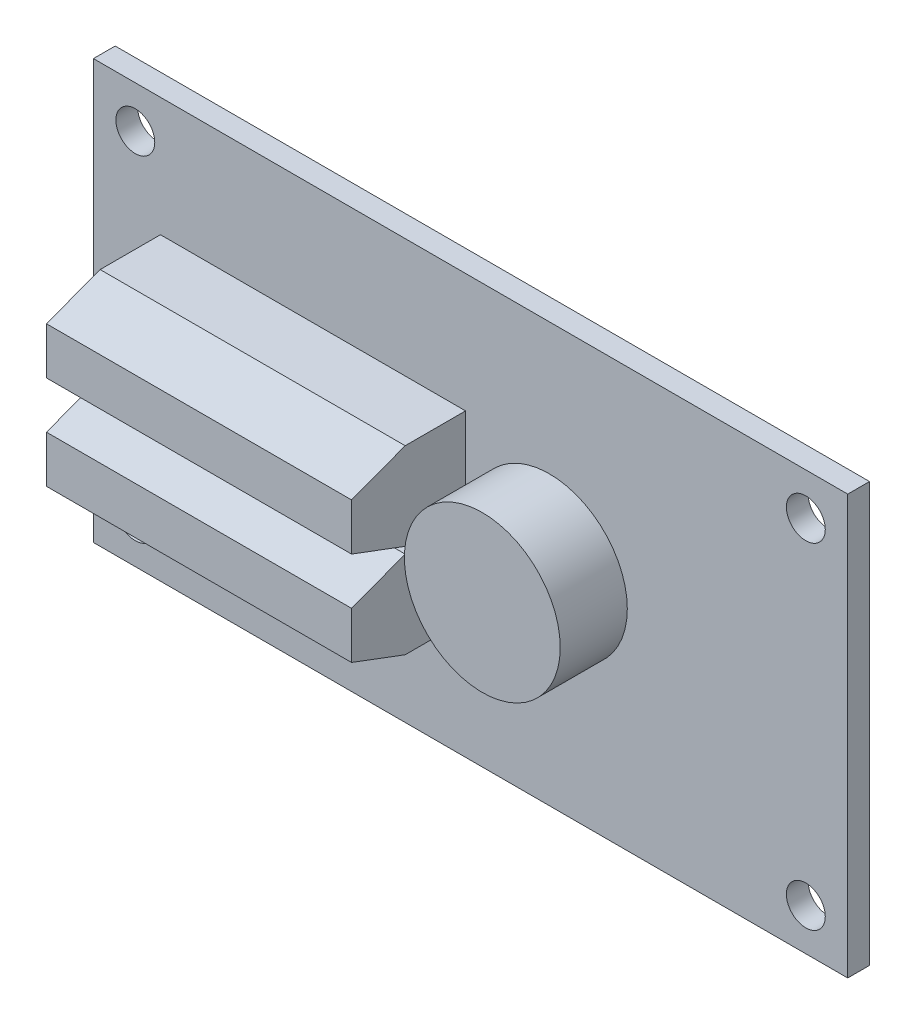
ISO-10303-21;
HEADER;
FILE_DESCRIPTION(('STEP AP214'),'2;1');
FILE_NAME('part.step','',(''),(''),'','','');
FILE_SCHEMA(('AUTOMOTIVE_DESIGN { 1 0 10303 214 1 1 1 1 }'));
ENDSEC;
DATA;
#1=APPLICATION_CONTEXT('core data for automotive mechanical design processes');
#2=APPLICATION_PROTOCOL_DEFINITION('international standard','automotive_design',2000,#1);
#3=PRODUCT_CONTEXT('',#1,'mechanical');
#4=PRODUCT('Part','Part','',(#3));
#5=PRODUCT_RELATED_PRODUCT_CATEGORY('part','',(#4));
#6=PRODUCT_DEFINITION_FORMATION('','',#4);
#7=PRODUCT_DEFINITION_CONTEXT('part definition',#1,'design');
#8=PRODUCT_DEFINITION('design','',#6,#7);
#9=PRODUCT_DEFINITION_SHAPE('','',#8);
#10=(LENGTH_UNIT() NAMED_UNIT(*) SI_UNIT(.MILLI.,.METRE.));
#11=(NAMED_UNIT(*) PLANE_ANGLE_UNIT() SI_UNIT($,.RADIAN.));
#12=(NAMED_UNIT(*) SI_UNIT($,.STERADIAN.) SOLID_ANGLE_UNIT());
#13=UNCERTAINTY_MEASURE_WITH_UNIT(LENGTH_MEASURE(1.E-05),#10,'distance_accuracy_value','');
#14=(GEOMETRIC_REPRESENTATION_CONTEXT(3) GLOBAL_UNCERTAINTY_ASSIGNED_CONTEXT((#13)) GLOBAL_UNIT_ASSIGNED_CONTEXT((#10,
#11,#12)) REPRESENTATION_CONTEXT('',''));
#15=CARTESIAN_POINT('',(0.,0.,0.));
#16=DIRECTION('',(0.,0.,1.));
#17=DIRECTION('',(1.,0.,0.));
#18=AXIS2_PLACEMENT_3D('',#15,#16,#17);
#19=CARTESIAN_POINT('',(0.,0.,0.));
#20=DIRECTION('',(0.,0.,1.));
#21=DIRECTION('',(1.,0.,0.));
#22=AXIS2_PLACEMENT_3D('',#19,#20,#21);
#23=PLANE('',#22);
#24=DIRECTION('',(0.,-1.,0.));
#25=VECTOR('',#24,1.);
#26=CARTESIAN_POINT('',(20.193,4.953,0.));
#27=LINE('',#26,#25);
#28=CARTESIAN_POINT('',(20.193,4.953,0.));
#29=VERTEX_POINT('',#28);
#30=CARTESIAN_POINT('',(20.193,-4.953,0.));
#31=VERTEX_POINT('',#30);
#32=EDGE_CURVE('E239',#29,#31,#27,.T.);
#33=ORIENTED_EDGE('',*,*,#32,.F.);
#34=DIRECTION('',(1.,0.,0.));
#35=VECTOR('',#34,1.);
#36=CARTESIAN_POINT('',(20.193,4.953,0.));
#37=LINE('',#36,#35);
#38=CARTESIAN_POINT('',(10.287,4.953,0.));
#39=VERTEX_POINT('',#38);
#40=EDGE_CURVE('E245',#39,#29,#37,.T.);
#41=ORIENTED_EDGE('',*,*,#40,.F.);
#42=DIRECTION('',(0.,1.,0.));
#43=VECTOR('',#42,1.);
#44=CARTESIAN_POINT('',(10.287,4.953,0.));
#45=LINE('',#44,#43);
#46=CARTESIAN_POINT('',(10.287,-4.953,0.));
#47=VERTEX_POINT('',#46);
#48=EDGE_CURVE('E257',#47,#39,#45,.T.);
#49=ORIENTED_EDGE('',*,*,#48,.F.);
#50=DIRECTION('',(-1.,0.,0.));
#51=VECTOR('',#50,1.);
#52=CARTESIAN_POINT('',(20.193,-4.953,0.));
#53=LINE('',#52,#51);
#54=EDGE_CURVE('E254',#31,#47,#53,.T.);
#55=ORIENTED_EDGE('',*,*,#54,.F.);
#56=EDGE_LOOP('',(#33,#41,#49,#55));
#57=FACE_BOUND('',#56,.T.);
#58=CARTESIAN_POINT('',(-25.4,-12.7,0.));
#59=DIRECTION('',(0.,0.,1.));
#60=DIRECTION('',(1.,0.,0.));
#61=AXIS2_PLACEMENT_3D('',#58,#59,#60);
#62=CIRCLE('',#61,1.4732);
#63=CARTESIAN_POINT('',(-23.9268,-12.7,0.));
#64=VERTEX_POINT('',#63);
#65=EDGE_CURVE('E377',#64,#64,#62,.T.);
#66=ORIENTED_EDGE('',*,*,#65,.T.);
#67=EDGE_LOOP('',(#66));
#68=FACE_BOUND('',#67,.T.);
#69=CARTESIAN_POINT('',(-25.4,12.7,0.));
#70=DIRECTION('',(0.,0.,1.));
#71=DIRECTION('',(1.,0.,0.));
#72=AXIS2_PLACEMENT_3D('',#69,#70,#71);
#73=CIRCLE('',#72,1.4732);
#74=CARTESIAN_POINT('',(-23.9268,12.7,0.));
#75=VERTEX_POINT('',#74);
#76=EDGE_CURVE('E371',#75,#75,#73,.T.);
#77=ORIENTED_EDGE('',*,*,#76,.T.);
#78=EDGE_LOOP('',(#77));
#79=FACE_BOUND('',#78,.T.);
#80=CARTESIAN_POINT('',(25.4,12.7,0.));
#81=DIRECTION('',(0.,0.,1.));
#82=DIRECTION('',(1.,0.,0.));
#83=AXIS2_PLACEMENT_3D('',#80,#81,#82);
#84=CIRCLE('',#83,1.4732);
#85=CARTESIAN_POINT('',(26.8732,12.7,0.));
#86=VERTEX_POINT('',#85);
#87=EDGE_CURVE('E364',#86,#86,#84,.T.);
#88=ORIENTED_EDGE('',*,*,#87,.T.);
#89=EDGE_LOOP('',(#88));
#90=FACE_BOUND('',#89,.T.);
#91=CARTESIAN_POINT('',(25.4,-12.7,0.));
#92=DIRECTION('',(0.,0.,1.));
#93=DIRECTION('',(1.,0.,0.));
#94=AXIS2_PLACEMENT_3D('',#91,#92,#93);
#95=CIRCLE('',#94,1.4732);
#96=CARTESIAN_POINT('',(26.8732,-12.7,0.));
#97=VERTEX_POINT('',#96);
#98=EDGE_CURVE('E382',#97,#97,#95,.T.);
#99=ORIENTED_EDGE('',*,*,#98,.T.);
#100=EDGE_LOOP('',(#99));
#101=FACE_BOUND('',#100,.T.);
#102=DIRECTION('',(0.,1.,0.));
#103=VECTOR('',#102,1.);
#104=CARTESIAN_POINT('',(28.575,15.875,0.));
#105=LINE('',#104,#103);
#106=CARTESIAN_POINT('',(28.575,-15.875,0.));
#107=VERTEX_POINT('',#106);
#108=CARTESIAN_POINT('',(28.575,15.875,0.));
#109=VERTEX_POINT('',#108);
#110=EDGE_CURVE('E385',#107,#109,#105,.T.);
#111=ORIENTED_EDGE('',*,*,#110,.F.);
#112=DIRECTION('',(1.,0.,0.));
#113=VECTOR('',#112,1.);
#114=CARTESIAN_POINT('',(-28.575,-15.875,0.));
#115=LINE('',#114,#113);
#116=CARTESIAN_POINT('',(-28.575,-15.875,0.));
#117=VERTEX_POINT('',#116);
#118=EDGE_CURVE('E392',#117,#107,#115,.T.);
#119=ORIENTED_EDGE('',*,*,#118,.F.);
#120=DIRECTION('',(0.,-1.,0.));
#121=VECTOR('',#120,1.);
#122=CARTESIAN_POINT('',(-28.575,15.875,0.));
#123=LINE('',#122,#121);
#124=CARTESIAN_POINT('',(-28.575,15.875,0.));
#125=VERTEX_POINT('',#124);
#126=EDGE_CURVE('E403',#125,#117,#123,.T.);
#127=ORIENTED_EDGE('',*,*,#126,.F.);
#128=DIRECTION('',(-1.,0.,0.));
#129=VECTOR('',#128,1.);
#130=CARTESIAN_POINT('',(-28.575,15.875,0.));
#131=LINE('',#130,#129);
#132=EDGE_CURVE('E401',#109,#125,#131,.T.);
#133=ORIENTED_EDGE('',*,*,#132,.F.);
#134=EDGE_LOOP('',(#111,#119,#127,#133));
#135=FACE_BOUND('',#134,.T.);
#136=DIRECTION('',(0.,-1.,0.));
#137=VECTOR('',#136,1.);
#138=CARTESIAN_POINT('',(4.445,-9.906,0.));
#139=LINE('',#138,#137);
#140=CARTESIAN_POINT('',(4.445,-9.906,0.));
#141=VERTEX_POINT('',#140);
#142=CARTESIAN_POINT('',(4.445,-15.748,0.));
#143=VERTEX_POINT('',#142);
#144=EDGE_CURVE('E228',#141,#143,#139,.T.);
#145=ORIENTED_EDGE('',*,*,#144,.F.);
#146=DIRECTION('',(1.,0.,0.));
#147=VECTOR('',#146,1.);
#148=CARTESIAN_POINT('',(4.445,-9.906,0.));
#149=LINE('',#148,#147);
#150=CARTESIAN_POINT('',(-3.175,-9.906,0.));
#151=VERTEX_POINT('',#150);
#152=EDGE_CURVE('E225',#151,#141,#149,.T.);
#153=ORIENTED_EDGE('',*,*,#152,.F.);
#154=DIRECTION('',(0.,1.,0.));
#155=VECTOR('',#154,1.);
#156=CARTESIAN_POINT('',(-3.175,-9.906,0.));
#157=LINE('',#156,#155);
#158=CARTESIAN_POINT('',(-3.175,-15.748,0.));
#159=VERTEX_POINT('',#158);
#160=EDGE_CURVE('E67',#159,#151,#157,.T.);
#161=ORIENTED_EDGE('',*,*,#160,.F.);
#162=DIRECTION('',(-1.,0.,0.));
#163=VECTOR('',#162,1.);
#164=CARTESIAN_POINT('',(4.445,-15.748,0.));
#165=LINE('',#164,#163);
#166=EDGE_CURVE('E62',#143,#159,#165,.T.);
#167=ORIENTED_EDGE('',*,*,#166,.F.);
#168=EDGE_LOOP('',(#145,#153,#161,#167));
#169=FACE_BOUND('',#168,.T.);
#170=ADVANCED_FACE('F47',(#57,#68,#79,#90,#101,#135,#169),#23,.F.);
#171=CARTESIAN_POINT('',(-23.495,0.254000000000004,10.287));
#172=DIRECTION('',(-1.,0.,0.));
#173=DIRECTION('',(0.,0.,1.));
#174=AXIS2_PLACEMENT_3D('',#171,#172,#173);
#175=PLANE('',#174);
#176=DIRECTION('',(0.,1.,0.));
#177=VECTOR('',#176,1.);
#178=CARTESIAN_POINT('',(-23.495,0.254000000000004,10.287));
#179=LINE('',#178,#177);
#180=CARTESIAN_POINT('',(-23.495,1.778,10.287));
#181=VERTEX_POINT('',#180);
#182=CARTESIAN_POINT('',(-23.495,5.334,10.287));
#183=VERTEX_POINT('',#182);
#184=EDGE_CURVE('E294',#181,#183,#179,.T.);
#185=ORIENTED_EDGE('',*,*,#184,.T.);
#186=DIRECTION('',(0.,0.351123441588392,-0.936329177569045));
#187=VECTOR('',#186,1.);
#188=CARTESIAN_POINT('',(-23.495,6.858,6.223));
#189=LINE('',#188,#187);
#190=CARTESIAN_POINT('',(-23.495,6.858,6.223));
#191=VERTEX_POINT('',#190);
#192=EDGE_CURVE('E274',#183,#191,#189,.T.);
#193=ORIENTED_EDGE('',*,*,#192,.T.);
#194=DIRECTION('',(0.,0.,-1.));
#195=VECTOR('',#194,1.);
#196=CARTESIAN_POINT('',(-23.495,6.858,10.287));
#197=LINE('',#196,#195);
#198=CARTESIAN_POINT('',(-23.495,6.858,1.651));
#199=VERTEX_POINT('',#198);
#200=EDGE_CURVE('E301',#191,#199,#197,.T.);
#201=ORIENTED_EDGE('',*,*,#200,.T.);
#202=DIRECTION('',(0.,1.,0.));
#203=VECTOR('',#202,1.);
#204=CARTESIAN_POINT('',(-23.495,0.254000000000004,1.651));
#205=LINE('',#204,#203);
#206=CARTESIAN_POINT('',(-23.495,0.254000000000004,1.651));
#207=VERTEX_POINT('',#206);
#208=EDGE_CURVE('E285',#207,#199,#205,.T.);
#209=ORIENTED_EDGE('',*,*,#208,.F.);
#210=DIRECTION('',(0.,0.,-1.));
#211=VECTOR('',#210,1.);
#212=CARTESIAN_POINT('',(-23.495,0.254000000000004,10.287));
#213=LINE('',#212,#211);
#214=CARTESIAN_POINT('',(-23.495,0.254000000000004,6.223));
#215=VERTEX_POINT('',#214);
#216=EDGE_CURVE('E317',#215,#207,#213,.T.);
#217=ORIENTED_EDGE('',*,*,#216,.F.);
#218=DIRECTION('',(0.,0.351123441588392,0.936329177569045));
#219=VECTOR('',#218,1.);
#220=CARTESIAN_POINT('',(-23.495,0.254000000000004,6.223));
#221=LINE('',#220,#219);
#222=EDGE_CURVE('E287',#215,#181,#221,.T.);
#223=ORIENTED_EDGE('',*,*,#222,.T.);
#224=EDGE_LOOP('',(#185,#193,#201,#209,#217,#223));
#225=FACE_BOUND('',#224,.T.);
#226=ADVANCED_FACE('F439',(#225),#175,.T.);
#227=CARTESIAN_POINT('',(-23.495,0.254000000000004,10.287));
#228=DIRECTION('',(0.,-1.,0.));
#229=DIRECTION('',(0.,0.,-1.));
#230=AXIS2_PLACEMENT_3D('',#227,#228,#229);
#231=PLANE('',#230);
#232=DIRECTION('',(0.,0.,-1.));
#233=VECTOR('',#232,1.);
#234=CARTESIAN_POINT('',(-0.380999999999992,0.254000000000004,10.287));
#235=LINE('',#234,#233);
#236=CARTESIAN_POINT('',(-0.380999999999992,0.254000000000004,6.223));
#237=VERTEX_POINT('',#236);
#238=CARTESIAN_POINT('',(-0.380999999999992,0.254000000000004,1.651));
#239=VERTEX_POINT('',#238);
#240=EDGE_CURVE('E315',#237,#239,#235,.T.);
#241=ORIENTED_EDGE('',*,*,#240,.F.);
#242=DIRECTION('',(-1.,0.,0.));
#243=VECTOR('',#242,1.);
#244=CARTESIAN_POINT('',(28.576,0.254000000000004,6.223));
#245=LINE('',#244,#243);
#246=EDGE_CURVE('E278',#237,#215,#245,.T.);
#247=ORIENTED_EDGE('',*,*,#246,.T.);
#248=ORIENTED_EDGE('',*,*,#216,.T.);
#249=DIRECTION('',(-1.,0.,0.));
#250=VECTOR('',#249,1.);
#251=CARTESIAN_POINT('',(-23.495,0.254000000000004,1.651));
#252=LINE('',#251,#250);
#253=EDGE_CURVE('E304',#239,#207,#252,.T.);
#254=ORIENTED_EDGE('',*,*,#253,.F.);
#255=EDGE_LOOP('',(#241,#247,#248,#254));
#256=FACE_BOUND('',#255,.T.);
#257=ADVANCED_FACE('F447',(#256),#231,.T.);
#258=CARTESIAN_POINT('',(-0.380999999999992,0.254000000000004,10.287));
#259=DIRECTION('',(1.,0.,0.));
#260=DIRECTION('',(0.,0.,-1.));
#261=AXIS2_PLACEMENT_3D('',#258,#259,#260);
#262=PLANE('',#261);
#263=DIRECTION('',(0.,0.,-1.));
#264=VECTOR('',#263,1.);
#265=CARTESIAN_POINT('',(-0.380999999999992,6.858,10.287));
#266=LINE('',#265,#264);
#267=CARTESIAN_POINT('',(-0.380999999999992,6.858,6.223));
#268=VERTEX_POINT('',#267);
#269=CARTESIAN_POINT('',(-0.380999999999992,6.858,1.651));
#270=VERTEX_POINT('',#269);
#271=EDGE_CURVE('E313',#268,#270,#266,.T.);
#272=ORIENTED_EDGE('',*,*,#271,.F.);
#273=DIRECTION('',(0.,0.351123441588392,-0.936329177569045));
#274=VECTOR('',#273,1.);
#275=CARTESIAN_POINT('',(-0.380999999999992,6.858,6.223));
#276=LINE('',#275,#274);
#277=CARTESIAN_POINT('',(-0.380999999999992,5.334,10.287));
#278=VERTEX_POINT('',#277);
#279=EDGE_CURVE('E282',#278,#268,#276,.T.);
#280=ORIENTED_EDGE('',*,*,#279,.F.);
#281=DIRECTION('',(0.,-1.,0.));
#282=VECTOR('',#281,1.);
#283=CARTESIAN_POINT('',(-0.380999999999992,0.254000000000004,10.287));
#284=LINE('',#283,#282);
#285=CARTESIAN_POINT('',(-0.380999999999992,1.778,10.287));
#286=VERTEX_POINT('',#285);
#287=EDGE_CURVE('E297',#278,#286,#284,.T.);
#288=ORIENTED_EDGE('',*,*,#287,.T.);
#289=DIRECTION('',(0.,0.351123441588392,0.936329177569045));
#290=VECTOR('',#289,1.);
#291=CARTESIAN_POINT('',(-0.380999999999992,0.254000000000004,6.223));
#292=LINE('',#291,#290);
#293=EDGE_CURVE('E273',#237,#286,#292,.T.);
#294=ORIENTED_EDGE('',*,*,#293,.F.);
#295=ORIENTED_EDGE('',*,*,#240,.T.);
#296=DIRECTION('',(0.,-1.,0.));
#297=VECTOR('',#296,1.);
#298=CARTESIAN_POINT('',(-0.380999999999992,0.254000000000004,1.651));
#299=LINE('',#298,#297);
#300=EDGE_CURVE('E307',#270,#239,#299,.T.);
#301=ORIENTED_EDGE('',*,*,#300,.F.);
#302=EDGE_LOOP('',(#272,#280,#288,#294,#295,#301));
#303=FACE_BOUND('',#302,.T.);
#304=ADVANCED_FACE('F508',(#303),#262,.T.);
#305=CARTESIAN_POINT('',(-23.495,6.858,10.287));
#306=DIRECTION('',(0.,1.,0.));
#307=DIRECTION('',(0.,0.,1.));
#308=AXIS2_PLACEMENT_3D('',#305,#306,#307);
#309=PLANE('',#308);
#310=ORIENTED_EDGE('',*,*,#200,.F.);
#311=DIRECTION('',(-1.,0.,0.));
#312=VECTOR('',#311,1.);
#313=CARTESIAN_POINT('',(28.576,6.858,6.223));
#314=LINE('',#313,#312);
#315=EDGE_CURVE('E277',#268,#191,#314,.T.);
#316=ORIENTED_EDGE('',*,*,#315,.F.);
#317=ORIENTED_EDGE('',*,*,#271,.T.);
#318=DIRECTION('',(1.,0.,0.));
#319=VECTOR('',#318,1.);
#320=CARTESIAN_POINT('',(-23.495,6.858,1.651));
#321=LINE('',#320,#319);
#322=EDGE_CURVE('E298',#199,#270,#321,.T.);
#323=ORIENTED_EDGE('',*,*,#322,.F.);
#324=EDGE_LOOP('',(#310,#316,#317,#323));
#325=FACE_BOUND('',#324,.T.);
#326=ADVANCED_FACE('F512',(#325),#309,.T.);
#327=CARTESIAN_POINT('',(0.,0.,10.287));
#328=DIRECTION('',(0.,0.,1.));
#329=DIRECTION('',(1.,0.,0.));
#330=AXIS2_PLACEMENT_3D('',#327,#328,#329);
#331=PLANE('',#330);
#332=ORIENTED_EDGE('',*,*,#287,.F.);
#333=DIRECTION('',(-1.,0.,0.));
#334=VECTOR('',#333,1.);
#335=CARTESIAN_POINT('',(28.576,5.334,10.287));
#336=LINE('',#335,#334);
#337=EDGE_CURVE('E279',#278,#183,#336,.T.);
#338=ORIENTED_EDGE('',*,*,#337,.T.);
#339=ORIENTED_EDGE('',*,*,#184,.F.);
#340=DIRECTION('',(-1.,0.,0.));
#341=VECTOR('',#340,1.);
#342=CARTESIAN_POINT('',(28.576,1.778,10.287));
#343=LINE('',#342,#341);
#344=EDGE_CURVE('E290',#286,#181,#343,.T.);
#345=ORIENTED_EDGE('',*,*,#344,.F.);
#346=EDGE_LOOP('',(#332,#338,#339,#345));
#347=FACE_BOUND('',#346,.T.);
#348=ADVANCED_FACE('F516',(#347),#331,.T.);
#349=CARTESIAN_POINT('',(0.,0.,1.651));
#350=DIRECTION('',(0.,0.,1.));
#351=DIRECTION('',(1.,0.,0.));
#352=AXIS2_PLACEMENT_3D('',#349,#350,#351);
#353=PLANE('',#352);
#354=CARTESIAN_POINT('',(5.96900000000001,0.,1.651));
#355=DIRECTION('',(0.,0.,1.));
#356=DIRECTION('',(1.,0.,0.));
#357=AXIS2_PLACEMENT_3D('',#354,#355,#356);
#358=CIRCLE('',#357,5.9055);
#359=CARTESIAN_POINT('',(11.8745,0.,1.651));
#360=VERTEX_POINT('',#359);
#361=EDGE_CURVE('E229',#360,#360,#358,.T.);
#362=ORIENTED_EDGE('',*,*,#361,.F.);
#363=EDGE_LOOP('',(#362));
#364=FACE_BOUND('',#363,.T.);
#365=ORIENTED_EDGE('',*,*,#208,.T.);
#366=ORIENTED_EDGE('',*,*,#322,.T.);
#367=ORIENTED_EDGE('',*,*,#300,.T.);
#368=ORIENTED_EDGE('',*,*,#253,.T.);
#369=EDGE_LOOP('',(#365,#366,#367,#368));
#370=FACE_BOUND('',#369,.T.);
#371=CARTESIAN_POINT('',(-25.4,-12.7,1.651));
#372=DIRECTION('',(0.,0.,1.));
#373=DIRECTION('',(1.,0.,0.));
#374=AXIS2_PLACEMENT_3D('',#371,#372,#373);
#375=CIRCLE('',#374,1.4732);
#376=CARTESIAN_POINT('',(-23.9268,-12.7,1.651));
#377=VERTEX_POINT('',#376);
#378=EDGE_CURVE('E363',#377,#377,#375,.T.);
#379=ORIENTED_EDGE('',*,*,#378,.F.);
#380=EDGE_LOOP('',(#379));
#381=FACE_BOUND('',#380,.T.);
#382=CARTESIAN_POINT('',(-25.4,12.7,1.651));
#383=DIRECTION('',(0.,0.,1.));
#384=DIRECTION('',(1.,0.,0.));
#385=AXIS2_PLACEMENT_3D('',#382,#383,#384);
#386=CIRCLE('',#385,1.4732);
#387=CARTESIAN_POINT('',(-23.9268,12.7,1.651));
#388=VERTEX_POINT('',#387);
#389=EDGE_CURVE('E374',#388,#388,#386,.T.);
#390=ORIENTED_EDGE('',*,*,#389,.F.);
#391=EDGE_LOOP('',(#390));
#392=FACE_BOUND('',#391,.T.);
#393=CARTESIAN_POINT('',(25.4,12.7,1.651));
#394=DIRECTION('',(0.,0.,1.));
#395=DIRECTION('',(1.,0.,0.));
#396=AXIS2_PLACEMENT_3D('',#393,#394,#395);
#397=CIRCLE('',#396,1.4732);
#398=CARTESIAN_POINT('',(26.8732,12.7,1.651));
#399=VERTEX_POINT('',#398);
#400=EDGE_CURVE('E368',#399,#399,#397,.T.);
#401=ORIENTED_EDGE('',*,*,#400,.F.);
#402=EDGE_LOOP('',(#401));
#403=FACE_BOUND('',#402,.T.);
#404=CARTESIAN_POINT('',(25.4,-12.7,1.651));
#405=DIRECTION('',(0.,0.,1.));
#406=DIRECTION('',(1.,0.,0.));
#407=AXIS2_PLACEMENT_3D('',#404,#405,#406);
#408=CIRCLE('',#407,1.4732);
#409=CARTESIAN_POINT('',(26.8732,-12.7,1.651));
#410=VERTEX_POINT('',#409);
#411=EDGE_CURVE('E367',#410,#410,#408,.T.);
#412=ORIENTED_EDGE('',*,*,#411,.F.);
#413=EDGE_LOOP('',(#412));
#414=FACE_BOUND('',#413,.T.);
#415=DIRECTION('',(0.,1.,0.));
#416=VECTOR('',#415,1.);
#417=CARTESIAN_POINT('',(28.575,15.875,1.651));
#418=LINE('',#417,#416);
#419=CARTESIAN_POINT('',(28.575,-15.875,1.651));
#420=VERTEX_POINT('',#419);
#421=CARTESIAN_POINT('',(28.575,15.875,1.651));
#422=VERTEX_POINT('',#421);
#423=EDGE_CURVE('E388',#420,#422,#418,.T.);
#424=ORIENTED_EDGE('',*,*,#423,.T.);
#425=DIRECTION('',(-1.,0.,0.));
#426=VECTOR('',#425,1.);
#427=CARTESIAN_POINT('',(-28.575,15.875,1.651));
#428=LINE('',#427,#426);
#429=CARTESIAN_POINT('',(-28.575,15.875,1.651));
#430=VERTEX_POINT('',#429);
#431=EDGE_CURVE('E391',#422,#430,#428,.T.);
#432=ORIENTED_EDGE('',*,*,#431,.T.);
#433=DIRECTION('',(0.,-1.,0.));
#434=VECTOR('',#433,1.);
#435=CARTESIAN_POINT('',(-28.575,15.875,1.651));
#436=LINE('',#435,#434);
#437=CARTESIAN_POINT('',(-28.575,-15.875,1.651));
#438=VERTEX_POINT('',#437);
#439=EDGE_CURVE('E394',#430,#438,#436,.T.);
#440=ORIENTED_EDGE('',*,*,#439,.T.);
#441=DIRECTION('',(1.,0.,0.));
#442=VECTOR('',#441,1.);
#443=CARTESIAN_POINT('',(-28.575,-15.875,1.651));
#444=LINE('',#443,#442);
#445=EDGE_CURVE('E396',#438,#420,#444,.T.);
#446=ORIENTED_EDGE('',*,*,#445,.T.);
#447=EDGE_LOOP('',(#424,#432,#440,#446));
#448=FACE_BOUND('',#447,.T.);
#449=DIRECTION('',(1.,0.,0.));
#450=VECTOR('',#449,1.);
#451=CARTESIAN_POINT('',(-23.495,-6.858,1.651));
#452=LINE('',#451,#450);
#453=CARTESIAN_POINT('',(-23.495,-6.858,1.651));
#454=VERTEX_POINT('',#453);
#455=CARTESIAN_POINT('',(-0.380999999999992,-6.858,1.651));
#456=VERTEX_POINT('',#455);
#457=EDGE_CURVE('E348',#454,#456,#452,.T.);
#458=ORIENTED_EDGE('',*,*,#457,.F.);
#459=DIRECTION('',(0.,-1.,0.));
#460=VECTOR('',#459,1.);
#461=CARTESIAN_POINT('',(-23.495,-0.254000000000004,1.651));
#462=LINE('',#461,#460);
#463=CARTESIAN_POINT('',(-23.495,-0.254000000000004,1.651));
#464=VERTEX_POINT('',#463);
#465=EDGE_CURVE('E329',#464,#454,#462,.T.);
#466=ORIENTED_EDGE('',*,*,#465,.F.);
#467=DIRECTION('',(-1.,0.,0.));
#468=VECTOR('',#467,1.);
#469=CARTESIAN_POINT('',(-23.495,-0.254000000000004,1.651));
#470=LINE('',#469,#468);
#471=CARTESIAN_POINT('',(-0.380999999999992,-0.254000000000004,1.651));
#472=VERTEX_POINT('',#471);
#473=EDGE_CURVE('E342',#472,#464,#470,.T.);
#474=ORIENTED_EDGE('',*,*,#473,.F.);
#475=DIRECTION('',(0.,1.,0.));
#476=VECTOR('',#475,1.);
#477=CARTESIAN_POINT('',(-0.380999999999992,-0.254000000000004,1.651));
#478=LINE('',#477,#476);
#479=EDGE_CURVE('E351',#456,#472,#478,.T.);
#480=ORIENTED_EDGE('',*,*,#479,.F.);
#481=EDGE_LOOP('',(#458,#466,#474,#480));
#482=FACE_BOUND('',#481,.T.);
#483=ADVANCED_FACE('F429',(#364,#370,#381,#392,#403,#414,#448,#482),#353,.T.);
#484=CARTESIAN_POINT('',(28.575,15.875,1.651));
#485=DIRECTION('',(-1.,0.,0.));
#486=DIRECTION('',(0.,0.,1.));
#487=AXIS2_PLACEMENT_3D('',#484,#485,#486);
#488=PLANE('',#487);
#489=ORIENTED_EDGE('',*,*,#110,.T.);
#490=DIRECTION('',(0.,0.,-1.));
#491=VECTOR('',#490,1.);
#492=CARTESIAN_POINT('',(28.575,15.875,1.651));
#493=LINE('',#492,#491);
#494=EDGE_CURVE('E11',#422,#109,#493,.T.);
#495=ORIENTED_EDGE('',*,*,#494,.F.);
#496=ORIENTED_EDGE('',*,*,#423,.F.);
#497=DIRECTION('',(0.,0.,-1.));
#498=VECTOR('',#497,1.);
#499=CARTESIAN_POINT('',(28.575,-15.875,1.651));
#500=LINE('',#499,#498);
#501=EDGE_CURVE('E398',#420,#107,#500,.T.);
#502=ORIENTED_EDGE('',*,*,#501,.T.);
#503=EDGE_LOOP('',(#489,#495,#496,#502));
#504=FACE_BOUND('',#503,.T.);
#505=ADVANCED_FACE('F49',(#504),#488,.F.);
#506=CARTESIAN_POINT('',(-28.575,15.875,1.651));
#507=DIRECTION('',(0.,-1.,0.));
#508=DIRECTION('',(0.,0.,-1.));
#509=AXIS2_PLACEMENT_3D('',#506,#507,#508);
#510=PLANE('',#509);
#511=ORIENTED_EDGE('',*,*,#132,.T.);
#512=DIRECTION('',(0.,0.,-1.));
#513=VECTOR('',#512,1.);
#514=CARTESIAN_POINT('',(-28.575,15.875,1.651));
#515=LINE('',#514,#513);
#516=EDGE_CURVE('E55',#430,#125,#515,.T.);
#517=ORIENTED_EDGE('',*,*,#516,.F.);
#518=ORIENTED_EDGE('',*,*,#431,.F.);
#519=ORIENTED_EDGE('',*,*,#494,.T.);
#520=EDGE_LOOP('',(#511,#517,#518,#519));
#521=FACE_BOUND('',#520,.T.);
#522=ADVANCED_FACE('F431',(#521),#510,.F.);
#523=CARTESIAN_POINT('',(-28.575,15.875,1.651));
#524=DIRECTION('',(1.,0.,0.));
#525=DIRECTION('',(0.,1.,0.));
#526=AXIS2_PLACEMENT_3D('',#523,#524,#525);
#527=PLANE('',#526);
#528=ORIENTED_EDGE('',*,*,#126,.T.);
#529=DIRECTION('',(0.,0.,-1.));
#530=VECTOR('',#529,1.);
#531=CARTESIAN_POINT('',(-28.575,-15.875,1.651));
#532=LINE('',#531,#530);
#533=EDGE_CURVE('E408',#438,#117,#532,.T.);
#534=ORIENTED_EDGE('',*,*,#533,.F.);
#535=ORIENTED_EDGE('',*,*,#439,.F.);
#536=ORIENTED_EDGE('',*,*,#516,.T.);
#537=EDGE_LOOP('',(#528,#534,#535,#536));
#538=FACE_BOUND('',#537,.T.);
#539=ADVANCED_FACE('F415',(#538),#527,.F.);
#540=CARTESIAN_POINT('',(-28.575,-15.875,1.651));
#541=DIRECTION('',(0.,1.,0.));
#542=DIRECTION('',(0.,0.,1.));
#543=AXIS2_PLACEMENT_3D('',#540,#541,#542);
#544=PLANE('',#543);
#545=ORIENTED_EDGE('',*,*,#118,.T.);
#546=ORIENTED_EDGE('',*,*,#501,.F.);
#547=ORIENTED_EDGE('',*,*,#445,.F.);
#548=ORIENTED_EDGE('',*,*,#533,.T.);
#549=EDGE_LOOP('',(#545,#546,#547,#548));
#550=FACE_BOUND('',#549,.T.);
#551=ADVANCED_FACE('F423',(#550),#544,.F.);
#552=CARTESIAN_POINT('',(25.4,-12.7,0.));
#553=DIRECTION('',(0.,0.,1.));
#554=DIRECTION('',(1.,0.,0.));
#555=AXIS2_PLACEMENT_3D('',#552,#553,#554);
#556=CYLINDRICAL_SURFACE('',#555,1.4732);
#557=ORIENTED_EDGE('',*,*,#98,.F.);
#558=EDGE_LOOP('',(#557));
#559=FACE_BOUND('',#558,.T.);
#560=ORIENTED_EDGE('',*,*,#411,.T.);
#561=EDGE_LOOP('',(#560));
#562=FACE_BOUND('',#561,.T.);
#563=ADVANCED_FACE('F455',(#559,#562),#556,.F.);
#564=CARTESIAN_POINT('',(25.4,12.7,0.));
#565=DIRECTION('',(0.,0.,1.));
#566=DIRECTION('',(1.,0.,0.));
#567=AXIS2_PLACEMENT_3D('',#564,#565,#566);
#568=CYLINDRICAL_SURFACE('',#567,1.4732);
#569=ORIENTED_EDGE('',*,*,#87,.F.);
#570=EDGE_LOOP('',(#569));
#571=FACE_BOUND('',#570,.T.);
#572=ORIENTED_EDGE('',*,*,#400,.T.);
#573=EDGE_LOOP('',(#572));
#574=FACE_BOUND('',#573,.T.);
#575=ADVANCED_FACE('F459',(#571,#574),#568,.F.);
#576=CARTESIAN_POINT('',(-25.4,12.7,0.));
#577=DIRECTION('',(0.,0.,1.));
#578=DIRECTION('',(1.,0.,0.));
#579=AXIS2_PLACEMENT_3D('',#576,#577,#578);
#580=CYLINDRICAL_SURFACE('',#579,1.4732);
#581=ORIENTED_EDGE('',*,*,#76,.F.);
#582=EDGE_LOOP('',(#581));
#583=FACE_BOUND('',#582,.T.);
#584=ORIENTED_EDGE('',*,*,#389,.T.);
#585=EDGE_LOOP('',(#584));
#586=FACE_BOUND('',#585,.T.);
#587=ADVANCED_FACE('F464',(#583,#586),#580,.F.);
#588=CARTESIAN_POINT('',(-25.4,-12.7,0.));
#589=DIRECTION('',(0.,0.,1.));
#590=DIRECTION('',(1.,0.,0.));
#591=AXIS2_PLACEMENT_3D('',#588,#589,#590);
#592=CYLINDRICAL_SURFACE('',#591,1.4732);
#593=ORIENTED_EDGE('',*,*,#65,.F.);
#594=EDGE_LOOP('',(#593));
#595=FACE_BOUND('',#594,.T.);
#596=ORIENTED_EDGE('',*,*,#378,.T.);
#597=EDGE_LOOP('',(#596));
#598=FACE_BOUND('',#597,.T.);
#599=ADVANCED_FACE('F470',(#595,#598),#592,.F.);
#600=CARTESIAN_POINT('',(-23.495,-0.254000000000004,10.287));
#601=DIRECTION('',(1.,0.,0.));
#602=DIRECTION('',(0.,0.,-1.));
#603=AXIS2_PLACEMENT_3D('',#600,#601,#602);
#604=PLANE('',#603);
#605=DIRECTION('',(0.,0.,-1.));
#606=VECTOR('',#605,1.);
#607=CARTESIAN_POINT('',(-23.495,-6.858,10.287));
#608=LINE('',#607,#606);
#609=CARTESIAN_POINT('',(-23.495,-6.858,6.223));
#610=VERTEX_POINT('',#609);
#611=EDGE_CURVE('E361',#610,#454,#608,.T.);
#612=ORIENTED_EDGE('',*,*,#611,.F.);
#613=DIRECTION('',(0.,-0.351123441588392,-0.936329177569045));
#614=VECTOR('',#613,1.);
#615=CARTESIAN_POINT('',(-23.495,-6.858,6.223));
#616=LINE('',#615,#614);
#617=CARTESIAN_POINT('',(-23.495,-5.334,10.287));
#618=VERTEX_POINT('',#617);
#619=EDGE_CURVE('E322',#618,#610,#616,.T.);
#620=ORIENTED_EDGE('',*,*,#619,.F.);
#621=DIRECTION('',(0.,-1.,0.));
#622=VECTOR('',#621,1.);
#623=CARTESIAN_POINT('',(-23.495,-0.254000000000004,10.287));
#624=LINE('',#623,#622);
#625=CARTESIAN_POINT('',(-23.495,-1.778,10.287));
#626=VERTEX_POINT('',#625);
#627=EDGE_CURVE('E338',#626,#618,#624,.T.);
#628=ORIENTED_EDGE('',*,*,#627,.F.);
#629=DIRECTION('',(0.,-0.351123441588392,0.936329177569045));
#630=VECTOR('',#629,1.);
#631=CARTESIAN_POINT('',(-23.495,-0.254000000000004,6.223));
#632=LINE('',#631,#630);
#633=CARTESIAN_POINT('',(-23.495,-0.254000000000004,6.223));
#634=VERTEX_POINT('',#633);
#635=EDGE_CURVE('E319',#634,#626,#632,.T.);
#636=ORIENTED_EDGE('',*,*,#635,.F.);
#637=DIRECTION('',(0.,0.,-1.));
#638=VECTOR('',#637,1.);
#639=CARTESIAN_POINT('',(-23.495,-0.254000000000004,10.287));
#640=LINE('',#639,#638);
#641=EDGE_CURVE('E345',#634,#464,#640,.T.);
#642=ORIENTED_EDGE('',*,*,#641,.T.);
#643=ORIENTED_EDGE('',*,*,#465,.T.);
#644=EDGE_LOOP('',(#612,#620,#628,#636,#642,#643));
#645=FACE_BOUND('',#644,.T.);
#646=ADVANCED_FACE('F473',(#645),#604,.F.);
#647=CARTESIAN_POINT('',(-23.495,-6.858,10.287));
#648=DIRECTION('',(0.,1.,0.));
#649=DIRECTION('',(0.,0.,1.));
#650=AXIS2_PLACEMENT_3D('',#647,#648,#649);
#651=PLANE('',#650);
#652=DIRECTION('',(0.,0.,-1.));
#653=VECTOR('',#652,1.);
#654=CARTESIAN_POINT('',(-0.380999999999992,-6.858,10.287));
#655=LINE('',#654,#653);
#656=CARTESIAN_POINT('',(-0.380999999999992,-6.858,6.223));
#657=VERTEX_POINT('',#656);
#658=EDGE_CURVE('E359',#657,#456,#655,.T.);
#659=ORIENTED_EDGE('',*,*,#658,.F.);
#660=DIRECTION('',(-1.,0.,0.));
#661=VECTOR('',#660,1.);
#662=CARTESIAN_POINT('',(28.576,-6.858,6.223));
#663=LINE('',#662,#661);
#664=EDGE_CURVE('E326',#657,#610,#663,.T.);
#665=ORIENTED_EDGE('',*,*,#664,.T.);
#666=ORIENTED_EDGE('',*,*,#611,.T.);
#667=ORIENTED_EDGE('',*,*,#457,.T.);
#668=EDGE_LOOP('',(#659,#665,#666,#667));
#669=FACE_BOUND('',#668,.T.);
#670=ADVANCED_FACE('F480',(#669),#651,.F.);
#671=CARTESIAN_POINT('',(-0.380999999999992,-0.254000000000004,10.287));
#672=DIRECTION('',(-1.,0.,0.));
#673=DIRECTION('',(0.,0.,1.));
#674=AXIS2_PLACEMENT_3D('',#671,#672,#673);
#675=PLANE('',#674);
#676=DIRECTION('',(0.,1.,0.));
#677=VECTOR('',#676,1.);
#678=CARTESIAN_POINT('',(-0.380999999999992,-0.254000000000004,10.287));
#679=LINE('',#678,#677);
#680=CARTESIAN_POINT('',(-0.380999999999992,-5.334,10.287));
#681=VERTEX_POINT('',#680);
#682=CARTESIAN_POINT('',(-0.380999999999992,-1.778,10.287));
#683=VERTEX_POINT('',#682);
#684=EDGE_CURVE('E341',#681,#683,#679,.T.);
#685=ORIENTED_EDGE('',*,*,#684,.F.);
#686=DIRECTION('',(0.,0.351123441588392,0.936329177569045));
#687=VECTOR('',#686,1.);
#688=CARTESIAN_POINT('',(-0.380999999999992,-6.858,6.223));
#689=LINE('',#688,#687);
#690=EDGE_CURVE('E320',#657,#681,#689,.T.);
#691=ORIENTED_EDGE('',*,*,#690,.F.);
#692=ORIENTED_EDGE('',*,*,#658,.T.);
#693=ORIENTED_EDGE('',*,*,#479,.T.);
#694=DIRECTION('',(0.,0.,-1.));
#695=VECTOR('',#694,1.);
#696=CARTESIAN_POINT('',(-0.380999999999992,-0.254000000000004,10.287));
#697=LINE('',#696,#695);
#698=CARTESIAN_POINT('',(-0.380999999999992,-0.254000000000004,6.223));
#699=VERTEX_POINT('',#698);
#700=EDGE_CURVE('E357',#699,#472,#697,.T.);
#701=ORIENTED_EDGE('',*,*,#700,.F.);
#702=DIRECTION('',(0.,0.351123441588392,-0.936329177569045));
#703=VECTOR('',#702,1.);
#704=CARTESIAN_POINT('',(-0.380999999999992,-0.254000000000004,6.223));
#705=LINE('',#704,#703);
#706=EDGE_CURVE('E323',#683,#699,#705,.T.);
#707=ORIENTED_EDGE('',*,*,#706,.F.);
#708=EDGE_LOOP('',(#685,#691,#692,#693,#701,#707));
#709=FACE_BOUND('',#708,.T.);
#710=ADVANCED_FACE('F484',(#709),#675,.F.);
#711=CARTESIAN_POINT('',(-23.495,-0.254000000000004,10.287));
#712=DIRECTION('',(0.,-1.,0.));
#713=DIRECTION('',(0.,0.,-1.));
#714=AXIS2_PLACEMENT_3D('',#711,#712,#713);
#715=PLANE('',#714);
#716=ORIENTED_EDGE('',*,*,#641,.F.);
#717=DIRECTION('',(-1.,0.,0.));
#718=VECTOR('',#717,1.);
#719=CARTESIAN_POINT('',(28.576,-0.254000000000004,6.223));
#720=LINE('',#719,#718);
#721=EDGE_CURVE('E332',#699,#634,#720,.T.);
#722=ORIENTED_EDGE('',*,*,#721,.F.);
#723=ORIENTED_EDGE('',*,*,#700,.T.);
#724=ORIENTED_EDGE('',*,*,#473,.T.);
#725=EDGE_LOOP('',(#716,#722,#723,#724));
#726=FACE_BOUND('',#725,.T.);
#727=ADVANCED_FACE('F488',(#726),#715,.F.);
#728=CARTESIAN_POINT('',(0.,0.,10.287));
#729=DIRECTION('',(0.,0.,1.));
#730=DIRECTION('',(1.,0.,0.));
#731=AXIS2_PLACEMENT_3D('',#728,#729,#730);
#732=PLANE('',#731);
#733=DIRECTION('',(-1.,0.,0.));
#734=VECTOR('',#733,1.);
#735=CARTESIAN_POINT('',(28.576,-5.334,10.287));
#736=LINE('',#735,#734);
#737=EDGE_CURVE('E325',#681,#618,#736,.T.);
#738=ORIENTED_EDGE('',*,*,#737,.F.);
#739=ORIENTED_EDGE('',*,*,#684,.T.);
#740=DIRECTION('',(-1.,0.,0.));
#741=VECTOR('',#740,1.);
#742=CARTESIAN_POINT('',(28.576,-1.778,10.287));
#743=LINE('',#742,#741);
#744=EDGE_CURVE('E333',#683,#626,#743,.T.);
#745=ORIENTED_EDGE('',*,*,#744,.T.);
#746=ORIENTED_EDGE('',*,*,#627,.T.);
#747=EDGE_LOOP('',(#738,#739,#745,#746));
#748=FACE_BOUND('',#747,.T.);
#749=ADVANCED_FACE('F492',(#748),#732,.T.);
#750=CARTESIAN_POINT('',(28.576,-0.254000000000004,6.223));
#751=DIRECTION('',(0.,-0.936329177569045,-0.351123441588392));
#752=DIRECTION('',(0.,0.351123441588392,-0.936329177569045));
#753=AXIS2_PLACEMENT_3D('',#750,#751,#752);
#754=PLANE('',#753);
#755=ORIENTED_EDGE('',*,*,#706,.T.);
#756=ORIENTED_EDGE('',*,*,#721,.T.);
#757=ORIENTED_EDGE('',*,*,#635,.T.);
#758=ORIENTED_EDGE('',*,*,#744,.F.);
#759=EDGE_LOOP('',(#755,#756,#757,#758));
#760=FACE_BOUND('',#759,.T.);
#761=ADVANCED_FACE('F496',(#760),#754,.F.);
#762=CARTESIAN_POINT('',(28.576,-6.858,6.223));
#763=DIRECTION('',(0.,0.936329177569045,-0.351123441588392));
#764=DIRECTION('',(0.,0.351123441588392,0.936329177569045));
#765=AXIS2_PLACEMENT_3D('',#762,#763,#764);
#766=PLANE('',#765);
#767=ORIENTED_EDGE('',*,*,#690,.T.);
#768=ORIENTED_EDGE('',*,*,#737,.T.);
#769=ORIENTED_EDGE('',*,*,#619,.T.);
#770=ORIENTED_EDGE('',*,*,#664,.F.);
#771=EDGE_LOOP('',(#767,#768,#769,#770));
#772=FACE_BOUND('',#771,.T.);
#773=ADVANCED_FACE('F500',(#772),#766,.F.);
#774=CARTESIAN_POINT('',(28.576,0.254000000000004,6.223));
#775=DIRECTION('',(0.,-0.936329177569045,0.351123441588392));
#776=DIRECTION('',(0.,-0.351123441588392,-0.936329177569045));
#777=AXIS2_PLACEMENT_3D('',#774,#775,#776);
#778=PLANE('',#777);
#779=ORIENTED_EDGE('',*,*,#293,.T.);
#780=ORIENTED_EDGE('',*,*,#344,.T.);
#781=ORIENTED_EDGE('',*,*,#222,.F.);
#782=ORIENTED_EDGE('',*,*,#246,.F.);
#783=EDGE_LOOP('',(#779,#780,#781,#782));
#784=FACE_BOUND('',#783,.T.);
#785=ADVANCED_FACE('F503',(#784),#778,.T.);
#786=CARTESIAN_POINT('',(28.576,6.858,6.223));
#787=DIRECTION('',(0.,0.936329177569045,0.351123441588392));
#788=DIRECTION('',(0.,-0.351123441588392,0.936329177569045));
#789=AXIS2_PLACEMENT_3D('',#786,#787,#788);
#790=PLANE('',#789);
#791=ORIENTED_EDGE('',*,*,#279,.T.);
#792=ORIENTED_EDGE('',*,*,#315,.T.);
#793=ORIENTED_EDGE('',*,*,#192,.F.);
#794=ORIENTED_EDGE('',*,*,#337,.F.);
#795=EDGE_LOOP('',(#791,#792,#793,#794));
#796=FACE_BOUND('',#795,.T.);
#797=ADVANCED_FACE('F523',(#796),#790,.T.);
#798=CARTESIAN_POINT('',(20.193,4.953,-1.524));
#799=DIRECTION('',(-1.,0.,0.));
#800=DIRECTION('',(0.,-1.,0.));
#801=AXIS2_PLACEMENT_3D('',#798,#799,#800);
#802=PLANE('',#801);
#803=ORIENTED_EDGE('',*,*,#32,.T.);
#804=DIRECTION('',(0.,0.,1.));
#805=VECTOR('',#804,1.);
#806=CARTESIAN_POINT('',(20.193,-4.953,-1.524));
#807=LINE('',#806,#805);
#808=CARTESIAN_POINT('',(20.193,-4.953,-1.524));
#809=VERTEX_POINT('',#808);
#810=EDGE_CURVE('E270',#809,#31,#807,.T.);
#811=ORIENTED_EDGE('',*,*,#810,.F.);
#812=DIRECTION('',(0.,-1.,0.));
#813=VECTOR('',#812,1.);
#814=CARTESIAN_POINT('',(20.193,4.953,-1.524));
#815=LINE('',#814,#813);
#816=CARTESIAN_POINT('',(20.193,4.953,-1.524));
#817=VERTEX_POINT('',#816);
#818=EDGE_CURVE('E241',#817,#809,#815,.T.);
#819=ORIENTED_EDGE('',*,*,#818,.F.);
#820=DIRECTION('',(0.,0.,1.));
#821=VECTOR('',#820,1.);
#822=CARTESIAN_POINT('',(20.193,4.953,-1.524));
#823=LINE('',#822,#821);
#824=EDGE_CURVE('E251',#817,#29,#823,.T.);
#825=ORIENTED_EDGE('',*,*,#824,.T.);
#826=EDGE_LOOP('',(#803,#811,#819,#825));
#827=FACE_BOUND('',#826,.T.);
#828=ADVANCED_FACE('F527',(#827),#802,.F.);
#829=CARTESIAN_POINT('',(20.193,-4.953,-1.524));
#830=DIRECTION('',(0.,1.,0.));
#831=DIRECTION('',(-1.,0.,0.));
#832=AXIS2_PLACEMENT_3D('',#829,#830,#831);
#833=PLANE('',#832);
#834=ORIENTED_EDGE('',*,*,#54,.T.);
#835=DIRECTION('',(0.,0.,1.));
#836=VECTOR('',#835,1.);
#837=CARTESIAN_POINT('',(10.287,-4.953,-1.524));
#838=LINE('',#837,#836);
#839=CARTESIAN_POINT('',(10.287,-4.953,-1.524));
#840=VERTEX_POINT('',#839);
#841=EDGE_CURVE('E267',#840,#47,#838,.T.);
#842=ORIENTED_EDGE('',*,*,#841,.F.);
#843=DIRECTION('',(-1.,0.,0.));
#844=VECTOR('',#843,1.);
#845=CARTESIAN_POINT('',(20.193,-4.953,-1.524));
#846=LINE('',#845,#844);
#847=EDGE_CURVE('E244',#809,#840,#846,.T.);
#848=ORIENTED_EDGE('',*,*,#847,.F.);
#849=ORIENTED_EDGE('',*,*,#810,.T.);
#850=EDGE_LOOP('',(#834,#842,#848,#849));
#851=FACE_BOUND('',#850,.T.);
#852=ADVANCED_FACE('F531',(#851),#833,.F.);
#853=CARTESIAN_POINT('',(10.287,4.953,-1.524));
#854=DIRECTION('',(1.,0.,0.));
#855=DIRECTION('',(0.,1.,0.));
#856=AXIS2_PLACEMENT_3D('',#853,#854,#855);
#857=PLANE('',#856);
#858=ORIENTED_EDGE('',*,*,#48,.T.);
#859=DIRECTION('',(0.,0.,1.));
#860=VECTOR('',#859,1.);
#861=CARTESIAN_POINT('',(10.287,4.953,-1.524));
#862=LINE('',#861,#860);
#863=CARTESIAN_POINT('',(10.287,4.953,-1.524));
#864=VERTEX_POINT('',#863);
#865=EDGE_CURVE('E264',#864,#39,#862,.T.);
#866=ORIENTED_EDGE('',*,*,#865,.F.);
#867=DIRECTION('',(0.,1.,0.));
#868=VECTOR('',#867,1.);
#869=CARTESIAN_POINT('',(10.287,4.953,-1.524));
#870=LINE('',#869,#868);
#871=EDGE_CURVE('E247',#840,#864,#870,.T.);
#872=ORIENTED_EDGE('',*,*,#871,.F.);
#873=ORIENTED_EDGE('',*,*,#841,.T.);
#874=EDGE_LOOP('',(#858,#866,#872,#873));
#875=FACE_BOUND('',#874,.T.);
#876=ADVANCED_FACE('F535',(#875),#857,.F.);
#877=CARTESIAN_POINT('',(20.193,4.953,-1.524));
#878=DIRECTION('',(0.,-1.,0.));
#879=DIRECTION('',(1.,0.,0.));
#880=AXIS2_PLACEMENT_3D('',#877,#878,#879);
#881=PLANE('',#880);
#882=ORIENTED_EDGE('',*,*,#40,.T.);
#883=ORIENTED_EDGE('',*,*,#824,.F.);
#884=DIRECTION('',(1.,0.,0.));
#885=VECTOR('',#884,1.);
#886=CARTESIAN_POINT('',(20.193,4.953,-1.524));
#887=LINE('',#886,#885);
#888=EDGE_CURVE('E249',#864,#817,#887,.T.);
#889=ORIENTED_EDGE('',*,*,#888,.F.);
#890=ORIENTED_EDGE('',*,*,#865,.T.);
#891=EDGE_LOOP('',(#882,#883,#889,#890));
#892=FACE_BOUND('',#891,.T.);
#893=ADVANCED_FACE('F539',(#892),#881,.F.);
#894=CARTESIAN_POINT('',(0.,0.,-1.524));
#895=DIRECTION('',(0.,0.,-1.));
#896=DIRECTION('',(-1.,0.,0.));
#897=AXIS2_PLACEMENT_3D('',#894,#895,#896);
#898=PLANE('',#897);
#899=ORIENTED_EDGE('',*,*,#818,.T.);
#900=ORIENTED_EDGE('',*,*,#847,.T.);
#901=ORIENTED_EDGE('',*,*,#871,.T.);
#902=ORIENTED_EDGE('',*,*,#888,.T.);
#903=EDGE_LOOP('',(#899,#900,#901,#902));
#904=FACE_BOUND('',#903,.T.);
#905=ADVANCED_FACE('F543',(#904),#898,.T.);
#906=CARTESIAN_POINT('',(5.96900000000001,0.,6.731));
#907=DIRECTION('',(0.,0.,-1.));
#908=DIRECTION('',(-1.,0.,0.));
#909=AXIS2_PLACEMENT_3D('',#906,#907,#908);
#910=CYLINDRICAL_SURFACE('',#909,5.9055);
#911=CARTESIAN_POINT('',(5.96900000000001,0.,6.731));
#912=DIRECTION('',(0.,0.,1.));
#913=DIRECTION('',(1.,0.,0.));
#914=AXIS2_PLACEMENT_3D('',#911,#912,#913);
#915=CIRCLE('',#914,5.9055);
#916=CARTESIAN_POINT('',(11.8745,0.,6.731));
#917=VERTEX_POINT('',#916);
#918=EDGE_CURVE('E232',#917,#917,#915,.T.);
#919=ORIENTED_EDGE('',*,*,#918,.F.);
#920=EDGE_LOOP('',(#919));
#921=FACE_BOUND('',#920,.T.);
#922=ORIENTED_EDGE('',*,*,#361,.T.);
#923=EDGE_LOOP('',(#922));
#924=FACE_BOUND('',#923,.T.);
#925=ADVANCED_FACE('F547',(#921,#924),#910,.T.);
#926=CARTESIAN_POINT('',(5.96900000000001,0.,6.731));
#927=DIRECTION('',(0.,0.,1.));
#928=DIRECTION('',(1.,0.,0.));
#929=AXIS2_PLACEMENT_3D('',#926,#927,#928);
#930=PLANE('',#929);
#931=ORIENTED_EDGE('',*,*,#918,.T.);
#932=EDGE_LOOP('',(#931));
#933=FACE_BOUND('',#932,.T.);
#934=ADVANCED_FACE('F551',(#933),#930,.T.);
#935=CARTESIAN_POINT('',(4.445,-9.906,-2.54));
#936=DIRECTION('',(-1.,0.,0.));
#937=DIRECTION('',(0.,-1.,0.));
#938=AXIS2_PLACEMENT_3D('',#935,#936,#937);
#939=PLANE('',#938);
#940=ORIENTED_EDGE('',*,*,#144,.T.);
#941=DIRECTION('',(0.,0.,1.));
#942=VECTOR('',#941,1.);
#943=CARTESIAN_POINT('',(4.445,-15.748,-2.54));
#944=LINE('',#943,#942);
#945=CARTESIAN_POINT('',(4.445,-15.748,-2.54));
#946=VERTEX_POINT('',#945);
#947=EDGE_CURVE('E209',#946,#143,#944,.T.);
#948=ORIENTED_EDGE('',*,*,#947,.F.);
#949=DIRECTION('',(0.,-1.,0.));
#950=VECTOR('',#949,1.);
#951=CARTESIAN_POINT('',(4.445,-9.906,-2.54));
#952=LINE('',#951,#950);
#953=CARTESIAN_POINT('',(4.445,-9.906,-2.54));
#954=VERTEX_POINT('',#953);
#955=EDGE_CURVE('E216',#954,#946,#952,.T.);
#956=ORIENTED_EDGE('',*,*,#955,.F.);
#957=DIRECTION('',(0.,0.,1.));
#958=VECTOR('',#957,1.);
#959=CARTESIAN_POINT('',(4.445,-9.906,-2.54));
#960=LINE('',#959,#958);
#961=EDGE_CURVE('E853',#954,#141,#960,.T.);
#962=ORIENTED_EDGE('',*,*,#961,.T.);
#963=EDGE_LOOP('',(#940,#948,#956,#962));
#964=FACE_BOUND('',#963,.T.);
#965=ADVANCED_FACE('F227',(#964),#939,.F.);
#966=CARTESIAN_POINT('',(4.445,-15.748,-2.54));
#967=DIRECTION('',(0.,1.,0.));
#968=DIRECTION('',(0.,0.,1.));
#969=AXIS2_PLACEMENT_3D('',#966,#967,#968);
#970=PLANE('',#969);
#971=ORIENTED_EDGE('',*,*,#166,.T.);
#972=DIRECTION('',(0.,0.,1.));
#973=VECTOR('',#972,1.);
#974=CARTESIAN_POINT('',(-3.175,-15.748,-2.54));
#975=LINE('',#974,#973);
#976=CARTESIAN_POINT('',(-3.175,-15.748,-2.54));
#977=VERTEX_POINT('',#976);
#978=EDGE_CURVE('E212',#977,#159,#975,.T.);
#979=ORIENTED_EDGE('',*,*,#978,.F.);
#980=DIRECTION('',(-1.,0.,0.));
#981=VECTOR('',#980,1.);
#982=CARTESIAN_POINT('',(4.445,-15.748,-2.54));
#983=LINE('',#982,#981);
#984=EDGE_CURVE('E205',#946,#977,#983,.T.);
#985=ORIENTED_EDGE('',*,*,#984,.F.);
#986=ORIENTED_EDGE('',*,*,#947,.T.);
#987=EDGE_LOOP('',(#971,#979,#985,#986));
#988=FACE_BOUND('',#987,.T.);
#989=ADVANCED_FACE('F207',(#988),#970,.F.);
#990=CARTESIAN_POINT('',(-3.175,-9.906,-2.54));
#991=DIRECTION('',(1.,0.,0.));
#992=DIRECTION('',(0.,1.,0.));
#993=AXIS2_PLACEMENT_3D('',#990,#991,#992);
#994=PLANE('',#993);
#995=ORIENTED_EDGE('',*,*,#160,.T.);
#996=DIRECTION('',(0.,0.,1.));
#997=VECTOR('',#996,1.);
#998=CARTESIAN_POINT('',(-3.175,-9.906,-2.54));
#999=LINE('',#998,#997);
#1000=CARTESIAN_POINT('',(-3.175,-9.906,-2.54));
#1001=VERTEX_POINT('',#1000);
#1002=EDGE_CURVE('E234',#1001,#151,#999,.T.);
#1003=ORIENTED_EDGE('',*,*,#1002,.F.);
#1004=DIRECTION('',(0.,1.,0.));
#1005=VECTOR('',#1004,1.);
#1006=CARTESIAN_POINT('',(-3.175,-9.906,-2.54));
#1007=LINE('',#1006,#1005);
#1008=EDGE_CURVE('E215',#977,#1001,#1007,.T.);
#1009=ORIENTED_EDGE('',*,*,#1008,.F.);
#1010=ORIENTED_EDGE('',*,*,#978,.T.);
#1011=EDGE_LOOP('',(#995,#1003,#1009,#1010));
#1012=FACE_BOUND('',#1011,.T.);
#1013=ADVANCED_FACE('F560',(#1012),#994,.F.);
#1014=CARTESIAN_POINT('',(4.445,-9.906,-2.54));
#1015=DIRECTION('',(0.,-1.,0.));
#1016=DIRECTION('',(1.,0.,0.));
#1017=AXIS2_PLACEMENT_3D('',#1014,#1015,#1016);
#1018=PLANE('',#1017);
#1019=ORIENTED_EDGE('',*,*,#152,.T.);
#1020=ORIENTED_EDGE('',*,*,#961,.F.);
#1021=DIRECTION('',(1.,0.,0.));
#1022=VECTOR('',#1021,1.);
#1023=CARTESIAN_POINT('',(4.445,-9.906,-2.54));
#1024=LINE('',#1023,#1022);
#1025=EDGE_CURVE('E221',#1001,#954,#1024,.T.);
#1026=ORIENTED_EDGE('',*,*,#1025,.F.);
#1027=ORIENTED_EDGE('',*,*,#1002,.T.);
#1028=EDGE_LOOP('',(#1019,#1020,#1026,#1027));
#1029=FACE_BOUND('',#1028,.T.);
#1030=ADVANCED_FACE('F563',(#1029),#1018,.F.);
#1031=CARTESIAN_POINT('',(0.,0.,-2.54));
#1032=DIRECTION('',(0.,0.,-1.));
#1033=DIRECTION('',(-1.,0.,0.));
#1034=AXIS2_PLACEMENT_3D('',#1031,#1032,#1033);
#1035=PLANE('',#1034);
#1036=ORIENTED_EDGE('',*,*,#955,.T.);
#1037=ORIENTED_EDGE('',*,*,#984,.T.);
#1038=ORIENTED_EDGE('',*,*,#1008,.T.);
#1039=ORIENTED_EDGE('',*,*,#1025,.T.);
#1040=EDGE_LOOP('',(#1036,#1037,#1038,#1039));
#1041=FACE_BOUND('',#1040,.T.);
#1042=ADVANCED_FACE('F219',(#1041),#1035,.T.);
#1043=CLOSED_SHELL('',(#170,#226,#257,#304,#326,#348,#483,#505,#522,#539,#551,#563,#575,#587,
#599,#646,#670,#710,#727,#749,#761,#773,#785,#797,#828,#852,#876,#893,#905,#925,#934,#965,#989,
#1013,#1030,#1042));
#1044=MANIFOLD_SOLID_BREP('B2',#1043);
#1045=ADVANCED_BREP_SHAPE_REPRESENTATION('',(#18,#1044),#14);
#1046=SHAPE_DEFINITION_REPRESENTATION(#9,#1045);
ENDSEC;
END-ISO-10303-21;
